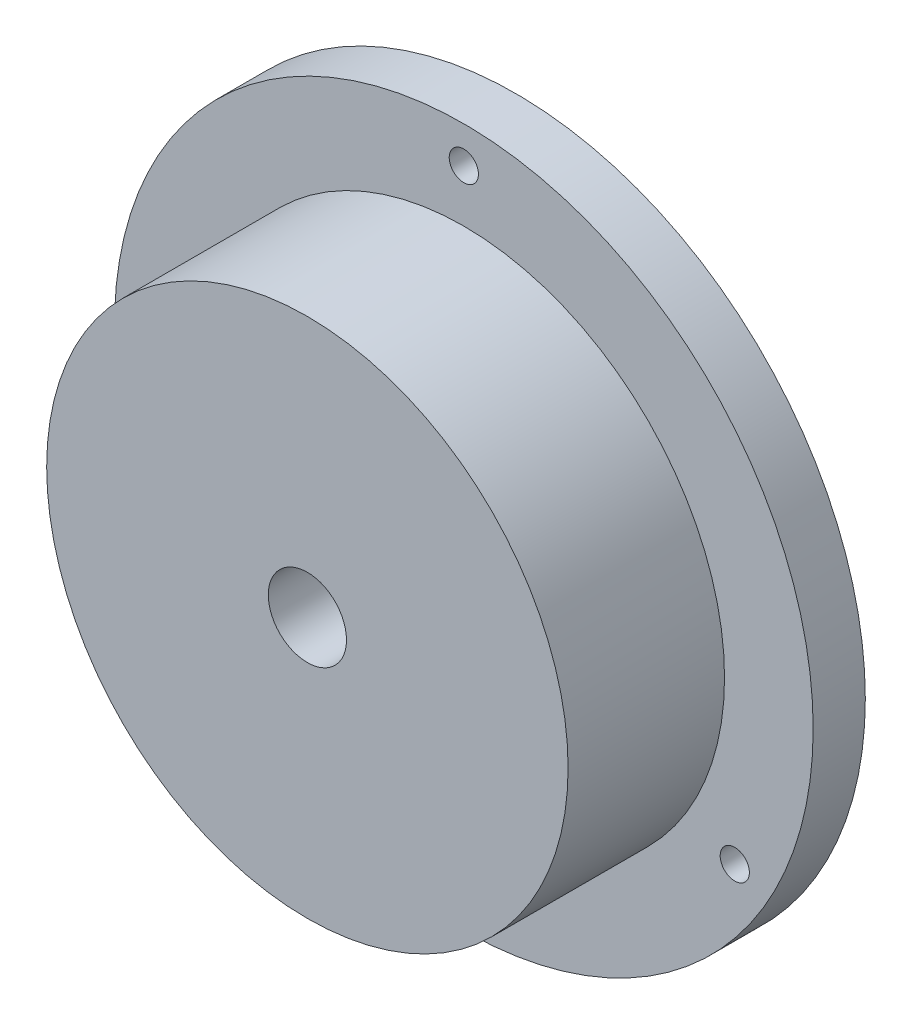
ISO-10303-21;
HEADER;
FILE_DESCRIPTION(('STEP AP214'),'2;1');
FILE_NAME('part.step','',(''),(''),'','','');
FILE_SCHEMA(('AUTOMOTIVE_DESIGN { 1 0 10303 214 1 1 1 1 }'));
ENDSEC;
DATA;
#1=APPLICATION_CONTEXT('core data for automotive mechanical design processes');
#2=APPLICATION_PROTOCOL_DEFINITION('international standard','automotive_design',2000,#1);
#3=PRODUCT_CONTEXT('',#1,'mechanical');
#4=PRODUCT('Part','Part','',(#3));
#5=PRODUCT_RELATED_PRODUCT_CATEGORY('part','',(#4));
#6=PRODUCT_DEFINITION_FORMATION('','',#4);
#7=PRODUCT_DEFINITION_CONTEXT('part definition',#1,'design');
#8=PRODUCT_DEFINITION('design','',#6,#7);
#9=PRODUCT_DEFINITION_SHAPE('','',#8);
#10=(LENGTH_UNIT() NAMED_UNIT(*) SI_UNIT(.MILLI.,.METRE.));
#11=(NAMED_UNIT(*) PLANE_ANGLE_UNIT() SI_UNIT($,.RADIAN.));
#12=(NAMED_UNIT(*) SI_UNIT($,.STERADIAN.) SOLID_ANGLE_UNIT());
#13=UNCERTAINTY_MEASURE_WITH_UNIT(LENGTH_MEASURE(1.E-05),#10,'distance_accuracy_value','');
#14=(GEOMETRIC_REPRESENTATION_CONTEXT(3) GLOBAL_UNCERTAINTY_ASSIGNED_CONTEXT((#13)) GLOBAL_UNIT_ASSIGNED_CONTEXT((#10,
#11,#12)) REPRESENTATION_CONTEXT('',''));
#15=CARTESIAN_POINT('',(0.,0.,0.));
#16=DIRECTION('',(0.,0.,1.));
#17=DIRECTION('',(1.,0.,0.));
#18=AXIS2_PLACEMENT_3D('',#15,#16,#17);
#19=CARTESIAN_POINT('',(0.,0.,3.175));
#20=DIRECTION('',(0.,0.,1.));
#21=DIRECTION('',(1.,0.,0.));
#22=AXIS2_PLACEMENT_3D('',#19,#20,#21);
#23=PLANE('',#22);
#24=CARTESIAN_POINT('',(16.4977839420936,-9.52499999999985,3.175));
#25=DIRECTION('',(0.,0.,1.));
#26=DIRECTION('',(1.,0.,0.));
#27=AXIS2_PLACEMENT_3D('',#24,#25,#26);
#28=CIRCLE('',#27,0.888999999999987);
#29=CARTESIAN_POINT('',(17.3867839420936,-9.52499999999985,3.175));
#30=VERTEX_POINT('',#29);
#31=EDGE_CURVE('E76',#30,#30,#28,.T.);
#32=ORIENTED_EDGE('',*,*,#31,.F.);
#33=EDGE_LOOP('',(#32));
#34=FACE_BOUND('',#33,.T.);
#35=CARTESIAN_POINT('',(-16.4977839420935,-9.52500000000008,3.175));
#36=DIRECTION('',(0.,0.,1.));
#37=DIRECTION('',(1.,0.,0.));
#38=AXIS2_PLACEMENT_3D('',#35,#36,#37);
#39=CIRCLE('',#38,0.888999999999987);
#40=CARTESIAN_POINT('',(-15.6087839420935,-9.52500000000008,3.175));
#41=VERTEX_POINT('',#40);
#42=EDGE_CURVE('E70',#41,#41,#39,.T.);
#43=ORIENTED_EDGE('',*,*,#42,.F.);
#44=EDGE_LOOP('',(#43));
#45=FACE_BOUND('',#44,.T.);
#46=CARTESIAN_POINT('',(0.,19.05,3.175));
#47=DIRECTION('',(0.,0.,1.));
#48=DIRECTION('',(1.,0.,0.));
#49=AXIS2_PLACEMENT_3D('',#46,#47,#48);
#50=CIRCLE('',#49,0.888999999999987);
#51=CARTESIAN_POINT('',(0.888999999999987,19.05,3.175));
#52=VERTEX_POINT('',#51);
#53=EDGE_CURVE('E64',#52,#52,#50,.T.);
#54=ORIENTED_EDGE('',*,*,#53,.F.);
#55=EDGE_LOOP('',(#54));
#56=FACE_BOUND('',#55,.T.);
#57=CARTESIAN_POINT('',(0.,0.,3.175));
#58=DIRECTION('',(0.,0.,1.));
#59=DIRECTION('',(1.,0.,0.));
#60=AXIS2_PLACEMENT_3D('',#57,#58,#59);
#61=CIRCLE('',#60,21.2725);
#62=CARTESIAN_POINT('',(21.2725,0.,3.175));
#63=VERTEX_POINT('',#62);
#64=EDGE_CURVE('E10',#63,#63,#61,.T.);
#65=ORIENTED_EDGE('',*,*,#64,.T.);
#66=EDGE_LOOP('',(#65));
#67=FACE_BOUND('',#66,.T.);
#68=CARTESIAN_POINT('',(0.,0.,3.175));
#69=DIRECTION('',(0.,0.,1.));
#70=DIRECTION('',(1.,0.,0.));
#71=AXIS2_PLACEMENT_3D('',#68,#69,#70);
#72=CIRCLE('',#71,15.875);
#73=CARTESIAN_POINT('',(15.875,0.,3.175));
#74=VERTEX_POINT('',#73);
#75=EDGE_CURVE('E50',#74,#74,#72,.T.);
#76=ORIENTED_EDGE('',*,*,#75,.F.);
#77=EDGE_LOOP('',(#76));
#78=FACE_BOUND('',#77,.T.);
#79=ADVANCED_FACE('F30',(#34,#45,#56,#67,#78),#23,.T.);
#80=CARTESIAN_POINT('',(0.,0.,3.175));
#81=DIRECTION('',(0.,0.,-1.));
#82=DIRECTION('',(-1.,0.,0.));
#83=AXIS2_PLACEMENT_3D('',#80,#81,#82);
#84=CYLINDRICAL_SURFACE('',#83,21.2725);
#85=ORIENTED_EDGE('',*,*,#64,.F.);
#86=EDGE_LOOP('',(#85));
#87=FACE_BOUND('',#86,.T.);
#88=CARTESIAN_POINT('',(0.,0.,0.));
#89=DIRECTION('',(0.,0.,1.));
#90=DIRECTION('',(1.,0.,0.));
#91=AXIS2_PLACEMENT_3D('',#88,#89,#90);
#92=CIRCLE('',#91,21.2725);
#93=CARTESIAN_POINT('',(21.2725,0.,0.));
#94=VERTEX_POINT('',#93);
#95=EDGE_CURVE('E43',#94,#94,#92,.T.);
#96=ORIENTED_EDGE('',*,*,#95,.T.);
#97=EDGE_LOOP('',(#96));
#98=FACE_BOUND('',#97,.T.);
#99=ADVANCED_FACE('F32',(#87,#98),#84,.T.);
#100=CARTESIAN_POINT('',(0.,0.,0.));
#101=DIRECTION('',(0.,0.,1.));
#102=DIRECTION('',(1.,0.,0.));
#103=AXIS2_PLACEMENT_3D('',#100,#101,#102);
#104=PLANE('',#103);
#105=CARTESIAN_POINT('',(16.4977839420936,-9.52499999999985,0.));
#106=DIRECTION('',(0.,0.,1.));
#107=DIRECTION('',(1.,0.,0.));
#108=AXIS2_PLACEMENT_3D('',#105,#106,#107);
#109=CIRCLE('',#108,0.888999999999997);
#110=CARTESIAN_POINT('',(17.3867839420936,-9.52499999999985,0.));
#111=VERTEX_POINT('',#110);
#112=EDGE_CURVE('E73',#111,#111,#109,.T.);
#113=ORIENTED_EDGE('',*,*,#112,.T.);
#114=EDGE_LOOP('',(#113));
#115=FACE_BOUND('',#114,.T.);
#116=CARTESIAN_POINT('',(-16.4977839420935,-9.52500000000008,0.));
#117=DIRECTION('',(0.,0.,1.));
#118=DIRECTION('',(1.,0.,0.));
#119=AXIS2_PLACEMENT_3D('',#116,#117,#118);
#120=CIRCLE('',#119,0.888999999999999);
#121=CARTESIAN_POINT('',(-15.6087839420935,-9.52500000000008,0.));
#122=VERTEX_POINT('',#121);
#123=EDGE_CURVE('E67',#122,#122,#120,.T.);
#124=ORIENTED_EDGE('',*,*,#123,.T.);
#125=EDGE_LOOP('',(#124));
#126=FACE_BOUND('',#125,.T.);
#127=CARTESIAN_POINT('',(0.,19.05,0.));
#128=DIRECTION('',(0.,0.,1.));
#129=DIRECTION('',(1.,0.,0.));
#130=AXIS2_PLACEMENT_3D('',#127,#128,#129);
#131=CIRCLE('',#130,0.888999999999998);
#132=CARTESIAN_POINT('',(0.888999999999998,19.05,0.));
#133=VERTEX_POINT('',#132);
#134=EDGE_CURVE('E61',#133,#133,#131,.T.);
#135=ORIENTED_EDGE('',*,*,#134,.T.);
#136=EDGE_LOOP('',(#135));
#137=FACE_BOUND('',#136,.T.);
#138=CARTESIAN_POINT('',(0.,0.,0.));
#139=DIRECTION('',(0.,0.,1.));
#140=DIRECTION('',(1.,0.,0.));
#141=AXIS2_PLACEMENT_3D('',#138,#139,#140);
#142=CIRCLE('',#141,2.38125);
#143=CARTESIAN_POINT('',(2.38125,0.,0.));
#144=VERTEX_POINT('',#143);
#145=EDGE_CURVE('E53',#144,#144,#142,.T.);
#146=ORIENTED_EDGE('',*,*,#145,.T.);
#147=EDGE_LOOP('',(#146));
#148=FACE_BOUND('',#147,.T.);
#149=ORIENTED_EDGE('',*,*,#95,.F.);
#150=EDGE_LOOP('',(#149));
#151=FACE_BOUND('',#150,.T.);
#152=ADVANCED_FACE('F116',(#115,#126,#137,#148,#151),#104,.F.);
#153=CARTESIAN_POINT('',(0.,0.,12.7));
#154=DIRECTION('',(0.,0.,-1.));
#155=DIRECTION('',(-1.,0.,0.));
#156=AXIS2_PLACEMENT_3D('',#153,#154,#155);
#157=CYLINDRICAL_SURFACE('',#156,15.875);
#158=CARTESIAN_POINT('',(0.,-15.875,6.1976));
#159=CARTESIAN_POINT('',(-0.0967109410735142,-15.8749988004531,6.19760416389285));
#160=CARTESIAN_POINT('',(-0.193484678630448,-15.8741068793742,6.20575005051755));
#161=CARTESIAN_POINT('',(-0.384345958728122,-15.8706346034328,6.23812078433042));
#162=CARTESIAN_POINT('',(-0.47843047711299,-15.8680524201679,6.2623630438082));
#163=CARTESIAN_POINT('',(-0.66112206649134,-15.8614909109532,6.32620960757611));
#164=CARTESIAN_POINT('',(-0.74973252983398,-15.8575124607145,6.36580428475969));
#165=CARTESIAN_POINT('',(-0.919031731503223,-15.8486024989643,6.45921223983568));
#166=CARTESIAN_POINT('',(-0.999721969988388,-15.8436711684637,6.51302281795911));
#167=CARTESIAN_POINT('',(-1.15124953336445,-15.8333839621394,6.6335786471546));
#168=CARTESIAN_POINT('',(-1.2220486559737,-15.8280265592031,6.70037178928638));
#169=CARTESIAN_POINT('',(-1.35145567440715,-15.8175035433589,6.84489428926095));
#170=CARTESIAN_POINT('',(-1.41006298830151,-15.8123379396155,6.9226241688308));
#171=CARTESIAN_POINT('',(-1.51356059740835,-15.8027680257007,7.08705611926943));
#172=CARTESIAN_POINT('',(-1.55841588273034,-15.7983656707722,7.17378034981003));
#173=CARTESIAN_POINT('',(-1.63291260953262,-15.7908401195917,7.35358600422935));
#174=CARTESIAN_POINT('',(-1.6625544920372,-15.7877168862595,7.44666724373486));
#175=CARTESIAN_POINT('',(-1.70566869644553,-15.7831173206578,7.63615243405794));
#176=CARTESIAN_POINT('',(-1.71920481529205,-15.7816344921914,7.73254170857462));
#177=CARTESIAN_POINT('',(-1.72992052713317,-15.7804635748137,7.92623446620125));
#178=CARTESIAN_POINT('',(-1.72710062425111,-15.7807754305868,8.02353792104216));
#179=CARTESIAN_POINT('',(-1.70523684969685,-15.7831527073322,8.21585560673391));
#180=CARTESIAN_POINT('',(-1.68626283548068,-15.7852105776411,8.31087788588309));
#181=CARTESIAN_POINT('',(-1.63273823523889,-15.7908362285474,8.49638137114754));
#182=CARTESIAN_POINT('',(-1.59818740414012,-15.7944040329009,8.5868625057912));
#183=CARTESIAN_POINT('',(-1.51441349592697,-15.802656203886,8.76093475738922));
#184=CARTESIAN_POINT('',(-1.46515963404753,-15.8073429090746,8.84451094351193));
#185=CARTESIAN_POINT('',(-1.35339988743408,-15.817302894966,9.00223741950793));
#186=CARTESIAN_POINT('',(-1.29089354328807,-15.8225761960008,9.07638738246816));
#187=CARTESIAN_POINT('',(-1.15401397309561,-15.8331488351424,9.21356235619126));
#188=CARTESIAN_POINT('',(-1.07958045426567,-15.8384481653419,9.27652722026963));
#189=CARTESIAN_POINT('',(-0.921168208981226,-15.8484498335253,9.38907777733182));
#190=CARTESIAN_POINT('',(-0.837189468610389,-15.8531521706387,9.43866345080925));
#191=CARTESIAN_POINT('',(-0.662027415032831,-15.86143199394,9.52304645985648));
#192=CARTESIAN_POINT('',(-0.570842506744004,-15.8650092302097,9.55784051037289));
#193=CARTESIAN_POINT('',(-0.383877203322956,-15.8706333546968,9.61160732277614));
#194=CARTESIAN_POINT('',(-0.288096971087188,-15.872680297118,9.63058064504343));
#195=CARTESIAN_POINT('',(-0.0951804717098272,-15.8750062116698,9.65209057523174));
#196=CARTESIAN_POINT('',(0.00194644336352407,-15.8752941060143,9.65471013391056));
#197=CARTESIAN_POINT('',(0.195256130307848,-15.8740934651652,9.64365638543301));
#198=CARTESIAN_POINT('',(0.291438917298992,-15.8726049584676,9.62998333963262));
#199=CARTESIAN_POINT('',(0.479888905654951,-15.8680244211692,9.58680136032595));
#200=CARTESIAN_POINT('',(0.572165164636429,-15.864936347678,9.55733149973937));
#201=CARTESIAN_POINT('',(0.750464852883222,-15.8575028687365,9.48343273871489));
#202=CARTESIAN_POINT('',(0.836488117766245,-15.8531574302469,9.43900344518764));
#203=CARTESIAN_POINT('',(1.00021348936993,-15.843672496213,9.33624292985556));
#204=CARTESIAN_POINT('',(1.07788138149219,-15.8385299316185,9.27785748285233));
#205=CARTESIAN_POINT('',(1.22234438688751,-15.8280370029289,9.14891941726788));
#206=CARTESIAN_POINT('',(1.28913917586977,-15.822686632642,9.0783664359186));
#207=CARTESIAN_POINT('',(1.41025000009175,-15.8123540380528,8.92673295028301));
#208=CARTESIAN_POINT('',(1.46451141310147,-15.8073734870953,8.84560868853185));
#209=CARTESIAN_POINT('',(1.55863910323598,-15.7983706263709,8.67535013457682));
#210=CARTESIAN_POINT('',(1.5985056080642,-15.7943483014468,8.58621596910412));
#211=CARTESIAN_POINT('',(1.66262135317543,-15.7877281172567,8.40265149020378));
#212=CARTESIAN_POINT('',(1.68690253454864,-15.7851273462454,8.30823244262744));
#213=CARTESIAN_POINT('',(1.71926177779107,-15.7816359451561,8.1166275311174));
#214=CARTESIAN_POINT('',(1.72734039786619,-15.7807452561629,8.01944176261896));
#215=CARTESIAN_POINT('',(1.72705663833689,-15.7807762712172,7.82560519908621));
#216=CARTESIAN_POINT('',(1.71878006152703,-15.7816885166959,7.7289542655532));
#217=CARTESIAN_POINT('',(1.6862013412282,-15.7852023923203,7.5384249800142));
#218=CARTESIAN_POINT('',(1.66189918441038,-15.7878040238711,7.44454663031429));
#219=CARTESIAN_POINT('',(1.59798389301986,-15.7944008124682,7.26223156307745));
#220=CARTESIAN_POINT('',(1.55837381767599,-15.7983956910638,7.17379376235855));
#221=CARTESIAN_POINT('',(1.46497571588091,-15.80732938545,7.00480744711437));
#222=CARTESIAN_POINT('',(1.41118768392724,-15.8122682016069,6.92425893565092));
#223=CARTESIAN_POINT('',(1.29063929818695,-15.8225643560012,6.77289813648103));
#224=CARTESIAN_POINT('',(1.22381494728259,-15.8279236776293,6.70213695090774));
#225=CARTESIAN_POINT('',(1.07922065258758,-15.8384390282537,6.57279678224059));
#226=CARTESIAN_POINT('',(1.00144810527591,-15.8435950085201,6.51422070504329));
#227=CARTESIAN_POINT('',(0.836911086850277,-15.8531388217839,6.41077420343762));
#228=CARTESIAN_POINT('',(0.750120961710308,-15.8575243621506,6.36594439890857));
#229=CARTESIAN_POINT('',(0.570250187495908,-15.8650089557435,6.29155606902548));
#230=CARTESIAN_POINT('',(0.477176678832001,-15.868109441608,6.26198052846532));
#231=CARTESIAN_POINT('',(0.319658768061273,-15.8719058056913,6.22621912772198));
#232=CARTESIAN_POINT('',(0.256217154925606,-15.8730606393915,6.21550186382884));
#233=CARTESIAN_POINT('',(0.128526271540883,-15.8746081332279,6.20119093442634));
#234=CARTESIAN_POINT('',(0.064277005416565,-15.875000797255,6.19759723255135));
#235=CARTESIAN_POINT('',(0.,-15.875,6.1976));
#236=B_SPLINE_CURVE_WITH_KNOTS('',3,(#158,#159,#160,#161,#162,#163,#164,#165,#166,#167,#168,
#169,#170,#171,#172,#173,#174,#175,#176,#177,#178,#179,#180,#181,#182,#183,#184,#185,#186,#187,
#188,#189,#190,#191,#192,#193,#194,#195,#196,#197,#198,#199,#200,#201,#202,#203,#204,#205,#206,
#207,#208,#209,#210,#211,#212,#213,#214,#215,#216,#217,#218,#219,#220,#221,#222,#223,#224,#225,
#226,#227,#228,#229,#230,#231,#232,#233,#234,#235),.UNSPECIFIED.,.T.,.F.,(4,2,2,2,2,2,2,2,2,2,2,
2,2,2,2,2,2,2,2,2,2,2,2,2,2,2,2,2,2,2,2,2,2,2,2,2,2,2,4),(0.,0.289898085972432,
0.580110281915709,0.870140786800577,1.16011625098227,1.45118242655957,1.74226249189319,
2.03407755017991,2.32588414850551,2.61653097493721,2.90716884313499,3.19655621275472,
3.48594813552219,3.77595027979584,4.0659624789597,4.35748985706577,4.64901766020623,
4.94061017461775,5.23219236019449,5.52229435149331,5.81239168921635,6.10177476924651,
6.39116545399566,6.6816993555946,6.97224192079344,7.26402777642079,7.5558090162807,
7.84699034417928,8.1381616402116,8.42780944565579,8.71745749200704,9.00704768321472,
9.29663798681254,9.587687427571,9.87880619823589,10.1707771065549,10.462421630854,
10.6550976172655,10.8477726200673),.UNSPECIFIED.);
#237=CARTESIAN_POINT('',(0.,-15.875,6.1976));
#238=VERTEX_POINT('',#237);
#239=EDGE_CURVE('E79',#238,#238,#236,.T.);
#240=ORIENTED_EDGE('',*,*,#239,.T.);
#241=EDGE_LOOP('',(#240));
#242=FACE_BOUND('',#241,.T.);
#243=CARTESIAN_POINT('',(0.,0.,12.7));
#244=DIRECTION('',(0.,0.,1.));
#245=DIRECTION('',(1.,0.,0.));
#246=AXIS2_PLACEMENT_3D('',#243,#244,#245);
#247=CIRCLE('',#246,15.875);
#248=CARTESIAN_POINT('',(15.875,0.,12.7));
#249=VERTEX_POINT('',#248);
#250=EDGE_CURVE('E48',#249,#249,#247,.T.);
#251=ORIENTED_EDGE('',*,*,#250,.F.);
#252=EDGE_LOOP('',(#251));
#253=FACE_BOUND('',#252,.T.);
#254=ORIENTED_EDGE('',*,*,#75,.T.);
#255=EDGE_LOOP('',(#254));
#256=FACE_BOUND('',#255,.T.);
#257=ADVANCED_FACE('F85',(#242,#253,#256),#157,.T.);
#258=CARTESIAN_POINT('',(0.,0.,12.7));
#259=DIRECTION('',(0.,0.,1.));
#260=DIRECTION('',(1.,0.,0.));
#261=AXIS2_PLACEMENT_3D('',#258,#259,#260);
#262=PLANE('',#261);
#263=CARTESIAN_POINT('',(0.,0.,12.7));
#264=DIRECTION('',(0.,0.,1.));
#265=DIRECTION('',(1.,0.,0.));
#266=AXIS2_PLACEMENT_3D('',#263,#264,#265);
#267=CIRCLE('',#266,2.38125);
#268=CARTESIAN_POINT('',(2.38125,0.,12.7));
#269=VERTEX_POINT('',#268);
#270=EDGE_CURVE('E58',#269,#269,#267,.T.);
#271=ORIENTED_EDGE('',*,*,#270,.F.);
#272=EDGE_LOOP('',(#271));
#273=FACE_BOUND('',#272,.T.);
#274=ORIENTED_EDGE('',*,*,#250,.T.);
#275=EDGE_LOOP('',(#274));
#276=FACE_BOUND('',#275,.T.);
#277=ADVANCED_FACE('F109',(#273,#276),#262,.T.);
#278=CARTESIAN_POINT('',(0.,0.,12.7));
#279=DIRECTION('',(0.,0.,1.));
#280=DIRECTION('',(1.,0.,0.));
#281=AXIS2_PLACEMENT_3D('',#278,#279,#280);
#282=CYLINDRICAL_SURFACE('',#281,2.38125);
#283=CARTESIAN_POINT('',(0.,-2.38125,6.1976));
#284=CARTESIAN_POINT('',(0.0850026886326464,-2.38123960433156,6.19761113758022));
#285=CARTESIAN_POINT('',(0.170131316329848,-2.37664946391161,6.20392546775647));
#286=CARTESIAN_POINT('',(0.337755059783042,-2.35869190693766,6.22881471892754));
#287=CARTESIAN_POINT('',(0.420242425476976,-2.34530077146967,6.2474227725432));
#288=CARTESIAN_POINT('',(0.579685383718676,-2.3110444534792,6.29566486900906));
#289=CARTESIAN_POINT('',(0.656670833789365,-2.29022398714768,6.32523298508959));
#290=CARTESIAN_POINT('',(0.804121583357064,-2.2427101352369,6.3940371811987));
#291=CARTESIAN_POINT('',(0.874589185048701,-2.21601883465752,6.43326982950487));
#292=CARTESIAN_POINT('',(1.01430090245177,-2.15588507582042,6.52409459531253));
#293=CARTESIAN_POINT('',(1.08285308650553,-2.12204969174514,6.57648544094934));
#294=CARTESIAN_POINT('',(1.21080470272799,-2.05174237657136,6.69009049033202));
#295=CARTESIAN_POINT('',(1.270189282637,-2.0152663048864,6.75131870721813));
#296=CARTESIAN_POINT('',(1.38971016924575,-1.93523893958423,6.89417583881912));
#297=CARTESIAN_POINT('',(1.44784748842795,-1.89165952804468,6.97747080558114));
#298=CARTESIAN_POINT('',(1.54942259100647,-1.80939145211568,7.15479069694342));
#299=CARTESIAN_POINT('',(1.59288306399383,-1.77069529703339,7.24879875594675));
#300=CARTESIAN_POINT('',(1.6515110829098,-1.7157853324708,7.41421694506738));
#301=CARTESIAN_POINT('',(1.67128299721248,-1.69636116750858,7.48291514070201));
#302=CARTESIAN_POINT('',(1.70229981474342,-1.66523744494414,7.62384002322995));
#303=CARTESIAN_POINT('',(1.71356344717716,-1.65352092795475,7.69605858521969));
#304=CARTESIAN_POINT('',(1.72683475835086,-1.63966394549644,7.84283309438511));
#305=CARTESIAN_POINT('',(1.72877569843226,-1.63759252994042,7.91740205948334));
#306=CARTESIAN_POINT('',(1.72304073615508,-1.64362211453728,8.06577442082653));
#307=CARTESIAN_POINT('',(1.71535760815299,-1.65173075777567,8.13957719986248));
#308=CARTESIAN_POINT('',(1.68957803909507,-1.67810723083093,8.29257628002333));
#309=CARTESIAN_POINT('',(1.67036546230521,-1.69745551741008,8.37138925715569));
#310=CARTESIAN_POINT('',(1.62204977634911,-1.74367919777594,8.52362041507012));
#311=CARTESIAN_POINT('',(1.59292394960002,-1.77057185542762,8.59702572919723));
#312=CARTESIAN_POINT('',(1.51471423008274,-1.83833394787484,8.76126310638399));
#313=CARTESIAN_POINT('',(1.46221424477206,-1.88087699027004,8.84976997668434));
#314=CARTESIAN_POINT('',(1.34301342448028,-1.96777264516445,9.01566163772194));
#315=CARTESIAN_POINT('',(1.27629735423009,-2.01212715744939,9.09303434583203));
#316=CARTESIAN_POINT('',(1.12847535091893,-2.09864840492193,9.23647471659115));
#317=CARTESIAN_POINT('',(1.04720504744989,-2.14078216870988,9.30239423842362));
#318=CARTESIAN_POINT('',(0.871809733853091,-2.2179778297542,9.41953266912506));
#319=CARTESIAN_POINT('',(0.777714967272673,-2.25305589822861,9.47078531033256));
#320=CARTESIAN_POINT('',(0.604259946447777,-2.30460239412803,9.54485148711709));
#321=CARTESIAN_POINT('',(0.527302322306033,-2.323536168006,9.57158706768968));
#322=CARTESIAN_POINT('',(0.368989387105585,-2.35386347811284,9.61410953681239));
#323=CARTESIAN_POINT('',(0.287637358620601,-2.36526256067551,9.62990447924661));
#324=CARTESIAN_POINT('',(0.122454278705588,-2.37954841202348,9.64966699006139));
#325=CARTESIAN_POINT('',(0.0386154257314912,-2.38240469972498,9.65359220726768));
#326=CARTESIAN_POINT('',(-0.128578592926906,-2.37924552667,9.64923613567525));
#327=CARTESIAN_POINT('',(-0.211933732532594,-2.37322959196239,9.64095419477428));
#328=CARTESIAN_POINT('',(-0.371043316082981,-2.35345669103941,9.61350070342755));
#329=CARTESIAN_POINT('',(-0.446963709197666,-2.34014335654487,9.5949526804647));
#330=CARTESIAN_POINT('',(-0.5943386705783,-2.30712418539987,9.54836387020833));
#331=CARTESIAN_POINT('',(-0.665792310843881,-2.28741702561531,9.52032111802927));
#332=CARTESIAN_POINT('',(-0.808876825277368,-2.24102584149144,9.45310219868711));
#333=CARTESIAN_POINT('',(-0.880010413329363,-2.21389235440178,9.4131843822084));
#334=CARTESIAN_POINT('',(-1.01481546062828,-2.15543724754085,9.32475671260323));
#335=CARTESIAN_POINT('',(-1.07848176702054,-2.12411276728229,9.27624098371926));
#336=CARTESIAN_POINT('',(-1.20880210442945,-2.05319387834803,9.1620698948424));
#337=CARTESIAN_POINT('',(-1.27387813674168,-2.01313394222891,9.09490250789191));
#338=CARTESIAN_POINT('',(-1.39246822660975,-1.93300382981878,8.95093892771693));
#339=CARTESIAN_POINT('',(-1.44597342724914,-1.89293366902414,8.87413542906708));
#340=CARTESIAN_POINT('',(-1.53459869637684,-1.82158573960677,8.72166329239791));
#341=CARTESIAN_POINT('',(-1.57118622216854,-1.78983638474929,8.64707240545384));
#342=CARTESIAN_POINT('',(-1.63380968661331,-1.7328625030002,8.49127920088952));
#343=CARTESIAN_POINT('',(-1.65986774424897,-1.70762433899344,8.41009117748196));
#344=CARTESIAN_POINT('',(-1.69573513310778,-1.67192696863984,8.25996110816251));
#345=CARTESIAN_POINT('',(-1.7078124305719,-1.65947333258575,8.19204812338322));
#346=CARTESIAN_POINT('',(-1.72372893138101,-1.64293943813523,8.05429269957786));
#347=CARTESIAN_POINT('',(-1.72757953164059,-1.63884759600954,7.98445306578228));
#348=CARTESIAN_POINT('',(-1.72676051192346,-1.63971018325818,7.84479423403456));
#349=CARTESIAN_POINT('',(-1.72208008245804,-1.644676089521,7.774975174277));
#350=CARTESIAN_POINT('',(-1.70454231189266,-1.66284037905774,7.63743107615923));
#351=CARTESIAN_POINT('',(-1.69167208120421,-1.67605173887857,7.56970951547473));
#352=CARTESIAN_POINT('',(-1.65336292846544,-1.71396218821014,7.4172968918053));
#353=CARTESIAN_POINT('',(-1.62526354650503,-1.74095357665873,7.33385875452051));
#354=CARTESIAN_POINT('',(-1.55797337456093,-1.80141977141974,7.17414437454155));
#355=CARTESIAN_POINT('',(-1.51876392056445,-1.83490545749492,7.0978804736133));
#356=CARTESIAN_POINT('',(-1.42901789326113,-1.90568159062989,6.95075659654733));
#357=CARTESIAN_POINT('',(-1.37818548390519,-1.9430542810767,6.88011782483561));
#358=CARTESIAN_POINT('',(-1.26647319139792,-2.01765105338166,6.74717259912349));
#359=CARTESIAN_POINT('',(-1.20558929257161,-2.05487506973078,6.68486949339195));
#360=CARTESIAN_POINT('',(-1.06030248569935,-2.13408522289339,6.55725035146471));
#361=CARTESIAN_POINT('',(-0.973646284282656,-2.1754260531323,6.49405719974357));
#362=CARTESIAN_POINT('',(-0.787339253804247,-2.24954133053765,6.38370675547761));
#363=CARTESIAN_POINT('',(-0.687707307748896,-2.28232802186435,6.33652651304381));
#364=CARTESIAN_POINT('',(-0.508130736991536,-2.32769312866698,6.27211177974633));
#365=CARTESIAN_POINT('',(-0.430634689864701,-2.34336641664608,6.25017773625332));
#366=CARTESIAN_POINT('',(-0.27233823329033,-2.36696643945198,6.21730625648848));
#367=CARTESIAN_POINT('',(-0.191548728880744,-2.37491686969282,6.20633518044543));
#368=CARTESIAN_POINT('',(-0.073605977182607,-2.38039995000909,6.19877268650992));
#369=CARTESIAN_POINT('',(-0.0368148002268589,-2.3812545023806,6.19759517629622));
#370=CARTESIAN_POINT('',(0.,-2.38125,6.1976));
#371=B_SPLINE_CURVE_WITH_KNOTS('',3,(#283,#284,#285,#286,#287,#288,#289,#290,#291,#292,#293,
#294,#295,#296,#297,#298,#299,#300,#301,#302,#303,#304,#305,#306,#307,#308,#309,#310,#311,#312,
#313,#314,#315,#316,#317,#318,#319,#320,#321,#322,#323,#324,#325,#326,#327,#328,#329,#330,#331,
#332,#333,#334,#335,#336,#337,#338,#339,#340,#341,#342,#343,#344,#345,#346,#347,#348,#349,#350,
#351,#352,#353,#354,#355,#356,#357,#358,#359,#360,#361,#362,#363,#364,#365,#366,#367,#368,#369,
#370),.UNSPECIFIED.,.T.,.F.,(4,2,2,2,2,2,2,2,2,2,2,2,2,2,2,2,2,2,2,2,2,2,2,2,2,2,2,2,2,2,2,2,2,
2,2,2,2,2,2,2,2,2,2,4),(0.,0.2548830933614,0.51045593577906,0.764515769514244,1.01848552033312,
1.29551317251059,1.57298502551778,1.90315149563599,2.23280518475108,2.45424568176368,
2.67519729172836,2.897728301309,3.12042648488668,3.36925669607236,3.61866101894232,
3.95102540742185,4.28374779599991,4.62049667157489,4.95646471735653,5.20634391844409,
5.45603897642622,5.70662390125825,5.95722221273726,6.19404725665838,6.43092134029436,
6.68785236172495,6.94495965004154,7.24902420438134,7.55332068812604,7.81925225383627,
8.08462224290887,8.2940185714728,8.50312462270688,8.7124958120391,8.92219733976997,
9.19695182427461,9.47217063855799,9.75538067238812,10.0387041266086,10.3816237075743,
10.7240497160201,10.9691909074226,11.2135775538058,11.3239678286811),.UNSPECIFIED.);
#372=CARTESIAN_POINT('',(0.,-2.38125,6.1976));
#373=VERTEX_POINT('',#372);
#374=EDGE_CURVE('E34',#373,#373,#371,.T.);
#375=ORIENTED_EDGE('',*,*,#374,.T.);
#376=EDGE_LOOP('',(#375));
#377=FACE_BOUND('',#376,.T.);
#378=ORIENTED_EDGE('',*,*,#145,.F.);
#379=EDGE_LOOP('',(#378));
#380=FACE_BOUND('',#379,.T.);
#381=ORIENTED_EDGE('',*,*,#270,.T.);
#382=EDGE_LOOP('',(#381));
#383=FACE_BOUND('',#382,.T.);
#384=ADVANCED_FACE('F105',(#377,#380,#383),#282,.F.);
#385=CARTESIAN_POINT('',(0.,19.05,3.175));
#386=DIRECTION('',(0.,0.,1.));
#387=DIRECTION('',(1.,0.,0.));
#388=AXIS2_PLACEMENT_3D('',#385,#386,#387);
#389=CYLINDRICAL_SURFACE('',#388,0.888999999999993);
#390=ORIENTED_EDGE('',*,*,#134,.F.);
#391=EDGE_LOOP('',(#390));
#392=FACE_BOUND('',#391,.T.);
#393=ORIENTED_EDGE('',*,*,#53,.T.);
#394=EDGE_LOOP('',(#393));
#395=FACE_BOUND('',#394,.T.);
#396=ADVANCED_FACE('F102',(#392,#395),#389,.F.);
#397=CARTESIAN_POINT('',(-16.4977839420935,-9.52500000000008,3.175));
#398=DIRECTION('',(0.,0.,1.));
#399=DIRECTION('',(1.,0.,0.));
#400=AXIS2_PLACEMENT_3D('',#397,#398,#399);
#401=CYLINDRICAL_SURFACE('',#400,0.888999999999993);
#402=ORIENTED_EDGE('',*,*,#123,.F.);
#403=EDGE_LOOP('',(#402));
#404=FACE_BOUND('',#403,.T.);
#405=ORIENTED_EDGE('',*,*,#42,.T.);
#406=EDGE_LOOP('',(#405));
#407=FACE_BOUND('',#406,.T.);
#408=ADVANCED_FACE('F98',(#404,#407),#401,.F.);
#409=CARTESIAN_POINT('',(16.4977839420936,-9.52499999999985,3.175));
#410=DIRECTION('',(0.,0.,1.));
#411=DIRECTION('',(1.,0.,0.));
#412=AXIS2_PLACEMENT_3D('',#409,#410,#411);
#413=CYLINDRICAL_SURFACE('',#412,0.888999999999992);
#414=ORIENTED_EDGE('',*,*,#112,.F.);
#415=EDGE_LOOP('',(#414));
#416=FACE_BOUND('',#415,.T.);
#417=ORIENTED_EDGE('',*,*,#31,.T.);
#418=EDGE_LOOP('',(#417));
#419=FACE_BOUND('',#418,.T.);
#420=ADVANCED_FACE('F93',(#416,#419),#413,.F.);
#421=CARTESIAN_POINT('',(0.,-21.2725,7.9248));
#422=DIRECTION('',(0.,-1.,0.));
#423=DIRECTION('',(0.,0.,-1.));
#424=AXIS2_PLACEMENT_3D('',#421,#422,#423);
#425=CYLINDRICAL_SURFACE('',#424,1.7272);
#426=ORIENTED_EDGE('',*,*,#374,.F.);
#427=EDGE_LOOP('',(#426));
#428=FACE_BOUND('',#427,.T.);
#429=ORIENTED_EDGE('',*,*,#239,.F.);
#430=EDGE_LOOP('',(#429));
#431=FACE_BOUND('',#430,.T.);
#432=ADVANCED_FACE('F89',(#428,#431),#425,.F.);
#433=CLOSED_SHELL('',(#79,#99,#152,#257,#277,#384,#396,#408,#420,#432));
#434=MANIFOLD_SOLID_BREP('B2',#433);
#435=ADVANCED_BREP_SHAPE_REPRESENTATION('',(#18,#434),#14);
#436=SHAPE_DEFINITION_REPRESENTATION(#9,#435);
ENDSEC;
END-ISO-10303-21;
